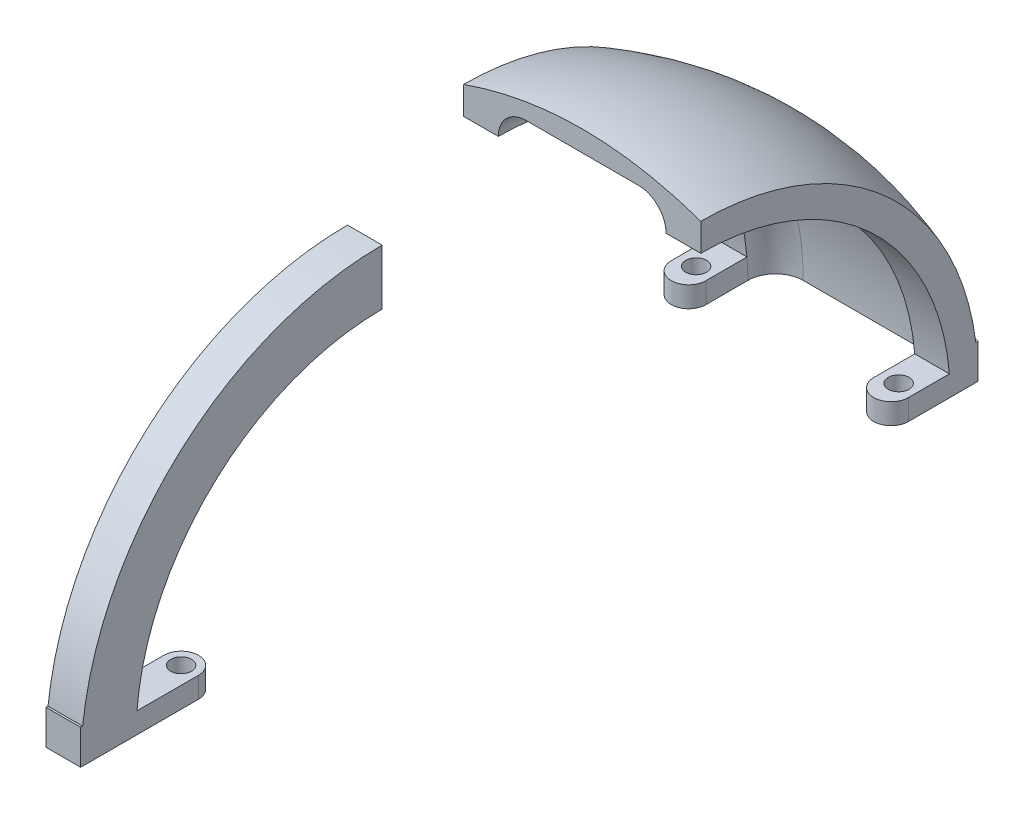
ISO-10303-21;
HEADER;
FILE_DESCRIPTION(('STEP AP214'),'2;1');
FILE_NAME('part.step','',(''),(''),'','','');
FILE_SCHEMA(('AUTOMOTIVE_DESIGN { 1 0 10303 214 1 1 1 1 }'));
ENDSEC;
DATA;
#1=APPLICATION_CONTEXT('core data for automotive mechanical design processes');
#2=APPLICATION_PROTOCOL_DEFINITION('international standard','automotive_design',2000,#1);
#3=PRODUCT_CONTEXT('',#1,'mechanical');
#4=PRODUCT('Part','Part','',(#3));
#5=PRODUCT_RELATED_PRODUCT_CATEGORY('part','',(#4));
#6=PRODUCT_DEFINITION_FORMATION('','',#4);
#7=PRODUCT_DEFINITION_CONTEXT('part definition',#1,'design');
#8=PRODUCT_DEFINITION('design','',#6,#7);
#9=PRODUCT_DEFINITION_SHAPE('','',#8);
#10=(LENGTH_UNIT() NAMED_UNIT(*) SI_UNIT(.MILLI.,.METRE.));
#11=(NAMED_UNIT(*) PLANE_ANGLE_UNIT() SI_UNIT($,.RADIAN.));
#12=(NAMED_UNIT(*) SI_UNIT($,.STERADIAN.) SOLID_ANGLE_UNIT());
#13=UNCERTAINTY_MEASURE_WITH_UNIT(LENGTH_MEASURE(1.E-05),#10,'distance_accuracy_value','');
#14=(GEOMETRIC_REPRESENTATION_CONTEXT(3) GLOBAL_UNCERTAINTY_ASSIGNED_CONTEXT((#13)) GLOBAL_UNIT_ASSIGNED_CONTEXT((#10,
#11,#12)) REPRESENTATION_CONTEXT('',''));
#15=CARTESIAN_POINT('',(0.,0.,0.));
#16=DIRECTION('',(0.,0.,1.));
#17=DIRECTION('',(1.,0.,0.));
#18=AXIS2_PLACEMENT_3D('',#15,#16,#17);
#19=CARTESIAN_POINT('',(1.94289029309402E-13,3.,41.9099999999999));
#20=DIRECTION('',(0.,-1.,0.));
#21=DIRECTION('',(0.,0.,-1.));
#22=AXIS2_PLACEMENT_3D('',#19,#20,#21);
#23=CYLINDRICAL_SURFACE('',#22,2.5);
#24=CARTESIAN_POINT('',(1.94289029309402E-13,0.,41.9099999999999));
#25=DIRECTION('',(0.,1.,0.));
#26=DIRECTION('',(0.,0.,1.));
#27=AXIS2_PLACEMENT_3D('',#24,#25,#26);
#28=CIRCLE('',#27,2.5);
#29=CARTESIAN_POINT('',(2.5000000000002,0.,41.9099999999999));
#30=VERTEX_POINT('',#29);
#31=CARTESIAN_POINT('',(-2.49999999999981,0.,41.9099999999999));
#32=VERTEX_POINT('',#31);
#33=EDGE_CURVE('E90',#30,#32,#28,.T.);
#34=ORIENTED_EDGE('',*,*,#33,.T.);
#35=DIRECTION('',(0.,-1.,0.));
#36=VECTOR('',#35,1.);
#37=CARTESIAN_POINT('',(-2.49999999999981,3.,41.9099999999999));
#38=LINE('',#37,#36);
#39=CARTESIAN_POINT('',(-2.49999999999981,3.,41.9099999999999));
#40=VERTEX_POINT('',#39);
#41=EDGE_CURVE('E56',#40,#32,#38,.T.);
#42=ORIENTED_EDGE('',*,*,#41,.F.);
#43=CARTESIAN_POINT('',(1.94289029309402E-13,3.,41.9099999999999));
#44=DIRECTION('',(0.,1.,0.));
#45=DIRECTION('',(0.,0.,1.));
#46=AXIS2_PLACEMENT_3D('',#43,#44,#45);
#47=CIRCLE('',#46,2.5);
#48=CARTESIAN_POINT('',(2.5000000000002,3.,41.9099999999999));
#49=VERTEX_POINT('',#48);
#50=EDGE_CURVE('E92',#49,#40,#47,.T.);
#51=ORIENTED_EDGE('',*,*,#50,.F.);
#52=DIRECTION('',(0.,-1.,0.));
#53=VECTOR('',#52,1.);
#54=CARTESIAN_POINT('',(2.5000000000002,3.,41.9099999999999));
#55=LINE('',#54,#53);
#56=EDGE_CURVE('E70',#49,#30,#55,.T.);
#57=ORIENTED_EDGE('',*,*,#56,.T.);
#58=EDGE_LOOP('',(#34,#42,#51,#57));
#59=FACE_BOUND('',#58,.T.);
#60=ADVANCED_FACE('F49',(#59),#23,.T.);
#61=CARTESIAN_POINT('',(-2.49999999999981,3.,0.));
#62=DIRECTION('',(1.,0.,0.));
#63=DIRECTION('',(0.,0.,-1.));
#64=AXIS2_PLACEMENT_3D('',#61,#62,#63);
#65=PLANE('',#64);
#66=DIRECTION('',(0.,0.,1.));
#67=VECTOR('',#66,1.);
#68=CARTESIAN_POINT('',(-2.49999999999981,5.,0.));
#69=LINE('',#68,#67);
#70=CARTESIAN_POINT('',(-2.4999999999998,5.,58.6216882336249));
#71=VERTEX_POINT('',#70);
#72=CARTESIAN_POINT('',(-2.4999999999998,5.,58.9099999999999));
#73=VERTEX_POINT('',#72);
#74=EDGE_CURVE('E275',#71,#73,#69,.T.);
#75=ORIENTED_EDGE('',*,*,#74,.F.);
#76=CARTESIAN_POINT('',(-2.4999999999998,0.,15.4099999999999));
#77=DIRECTION('',(1.,0.,0.));
#78=DIRECTION('',(0.,0.,-1.));
#79=AXIS2_PLACEMENT_3D('',#76,#77,#78);
#80=CIRCLE('',#79,43.5);
#81=CARTESIAN_POINT('',(-2.4999999999998,43.5,15.4099999999998));
#82=VERTEX_POINT('',#81);
#83=EDGE_CURVE('E281',#82,#71,#80,.T.);
#84=ORIENTED_EDGE('',*,*,#83,.F.);
#85=DIRECTION('',(0.,1.,0.));
#86=VECTOR('',#85,1.);
#87=CARTESIAN_POINT('',(-2.49999999999981,-15.4099999999999,15.41));
#88=LINE('',#87,#86);
#89=CARTESIAN_POINT('',(-2.49999999999981,35.5,15.4099999999998));
#90=VERTEX_POINT('',#89);
#91=EDGE_CURVE('E301',#90,#82,#88,.T.);
#92=ORIENTED_EDGE('',*,*,#91,.F.);
#93=CARTESIAN_POINT('',(-2.49999999999981,0.,15.4099999999999));
#94=DIRECTION('',(1.,0.,0.));
#95=DIRECTION('',(0.,0.,-1.));
#96=AXIS2_PLACEMENT_3D('',#93,#94,#95);
#97=CIRCLE('',#96,35.5);
#98=CARTESIAN_POINT('',(-2.49999999999981,3.,50.7830123116479));
#99=VERTEX_POINT('',#98);
#100=EDGE_CURVE('E131',#90,#99,#97,.T.);
#101=ORIENTED_EDGE('',*,*,#100,.T.);
#102=DIRECTION('',(0.,0.,1.));
#103=VECTOR('',#102,1.);
#104=CARTESIAN_POINT('',(-2.49999999999981,3.,0.));
#105=LINE('',#104,#103);
#106=EDGE_CURVE('E127',#40,#99,#105,.T.);
#107=ORIENTED_EDGE('',*,*,#106,.F.);
#108=ORIENTED_EDGE('',*,*,#41,.T.);
#109=DIRECTION('',(0.,0.,1.));
#110=VECTOR('',#109,1.);
#111=CARTESIAN_POINT('',(-2.49999999999981,0.,0.));
#112=LINE('',#111,#110);
#113=CARTESIAN_POINT('',(-2.4999999999998,0.,58.9099999999999));
#114=VERTEX_POINT('',#113);
#115=EDGE_CURVE('E103',#32,#114,#112,.T.);
#116=ORIENTED_EDGE('',*,*,#115,.T.);
#117=DIRECTION('',(0.,-1.,0.));
#118=VECTOR('',#117,1.);
#119=CARTESIAN_POINT('',(-2.4999999999998,3.,58.9099999999999));
#120=LINE('',#119,#118);
#121=EDGE_CURVE('E119',#73,#114,#120,.T.);
#122=ORIENTED_EDGE('',*,*,#121,.F.);
#123=EDGE_LOOP('',(#75,#84,#92,#101,#107,#108,#116,#122));
#124=FACE_BOUND('',#123,.T.);
#125=ADVANCED_FACE('F123',(#124),#65,.F.);
#126=CARTESIAN_POINT('',(0.,3.,58.9099999999999));
#127=DIRECTION('',(0.,0.,1.));
#128=DIRECTION('',(1.,0.,0.));
#129=AXIS2_PLACEMENT_3D('',#126,#127,#128);
#130=PLANE('',#129);
#131=DIRECTION('',(-1.,0.,0.));
#132=VECTOR('',#131,1.);
#133=CARTESIAN_POINT('',(0.,0.,58.9099999999999));
#134=LINE('',#133,#132);
#135=CARTESIAN_POINT('',(2.5000000000002,0.,58.9099999999999));
#136=VERTEX_POINT('',#135);
#137=EDGE_CURVE('E111',#136,#114,#134,.T.);
#138=ORIENTED_EDGE('',*,*,#137,.F.);
#139=DIRECTION('',(0.,-1.,0.));
#140=VECTOR('',#139,1.);
#141=CARTESIAN_POINT('',(2.5000000000002,3.,58.9099999999999));
#142=LINE('',#141,#140);
#143=CARTESIAN_POINT('',(2.5000000000002,5.,58.9099999999999));
#144=VERTEX_POINT('',#143);
#145=EDGE_CURVE('E94',#144,#136,#142,.T.);
#146=ORIENTED_EDGE('',*,*,#145,.F.);
#147=DIRECTION('',(-1.,0.,0.));
#148=VECTOR('',#147,1.);
#149=CARTESIAN_POINT('',(0.,5.,58.9099999999999));
#150=LINE('',#149,#148);
#151=EDGE_CURVE('E284',#144,#73,#150,.T.);
#152=ORIENTED_EDGE('',*,*,#151,.T.);
#153=ORIENTED_EDGE('',*,*,#121,.T.);
#154=EDGE_LOOP('',(#138,#146,#152,#153));
#155=FACE_BOUND('',#154,.T.);
#156=ADVANCED_FACE('F162',(#155),#130,.T.);
#157=CARTESIAN_POINT('',(2.50000000000019,3.,0.));
#158=DIRECTION('',(1.,0.,0.));
#159=DIRECTION('',(0.,0.,-1.));
#160=AXIS2_PLACEMENT_3D('',#157,#158,#159);
#161=PLANE('',#160);
#162=ORIENTED_EDGE('',*,*,#145,.T.);
#163=DIRECTION('',(0.,0.,1.));
#164=VECTOR('',#163,1.);
#165=CARTESIAN_POINT('',(2.50000000000019,0.,0.));
#166=LINE('',#165,#164);
#167=EDGE_CURVE('E101',#30,#136,#166,.T.);
#168=ORIENTED_EDGE('',*,*,#167,.F.);
#169=ORIENTED_EDGE('',*,*,#56,.F.);
#170=DIRECTION('',(0.,0.,1.));
#171=VECTOR('',#170,1.);
#172=CARTESIAN_POINT('',(2.50000000000019,3.,0.));
#173=LINE('',#172,#171);
#174=CARTESIAN_POINT('',(2.5000000000002,3.,50.7830123116479));
#175=VERTEX_POINT('',#174);
#176=EDGE_CURVE('E134',#49,#175,#173,.T.);
#177=ORIENTED_EDGE('',*,*,#176,.T.);
#178=CARTESIAN_POINT('',(2.5000000000002,0.,15.4099999999999));
#179=DIRECTION('',(1.,0.,0.));
#180=DIRECTION('',(0.,0.,-1.));
#181=AXIS2_PLACEMENT_3D('',#178,#179,#180);
#182=CIRCLE('',#181,35.5);
#183=CARTESIAN_POINT('',(2.5000000000002,35.5,15.4099999999998));
#184=VERTEX_POINT('',#183);
#185=EDGE_CURVE('E293',#184,#175,#182,.T.);
#186=ORIENTED_EDGE('',*,*,#185,.F.);
#187=DIRECTION('',(0.,1.,0.));
#188=VECTOR('',#187,1.);
#189=CARTESIAN_POINT('',(2.50000000000019,-15.4099999999999,15.41));
#190=LINE('',#189,#188);
#191=CARTESIAN_POINT('',(2.5000000000002,43.5,15.4099999999998));
#192=VERTEX_POINT('',#191);
#193=EDGE_CURVE('E296',#184,#192,#190,.T.);
#194=ORIENTED_EDGE('',*,*,#193,.T.);
#195=CARTESIAN_POINT('',(2.5000000000002,0.,15.4099999999999));
#196=DIRECTION('',(1.,0.,0.));
#197=DIRECTION('',(0.,0.,-1.));
#198=AXIS2_PLACEMENT_3D('',#195,#196,#197);
#199=CIRCLE('',#198,43.5);
#200=CARTESIAN_POINT('',(2.5000000000002,5.,58.6216882336249));
#201=VERTEX_POINT('',#200);
#202=EDGE_CURVE('E63',#192,#201,#199,.T.);
#203=ORIENTED_EDGE('',*,*,#202,.T.);
#204=DIRECTION('',(0.,0.,1.));
#205=VECTOR('',#204,1.);
#206=CARTESIAN_POINT('',(2.50000000000019,5.,0.));
#207=LINE('',#206,#205);
#208=EDGE_CURVE('E105',#201,#144,#207,.T.);
#209=ORIENTED_EDGE('',*,*,#208,.T.);
#210=EDGE_LOOP('',(#162,#168,#169,#177,#186,#194,#203,#209));
#211=FACE_BOUND('',#210,.T.);
#212=ADVANCED_FACE('F107',(#211),#161,.T.);
#213=CARTESIAN_POINT('',(1.94289029309402E-13,3.,41.9099999999999));
#214=DIRECTION('',(0.,-1.,0.));
#215=DIRECTION('',(0.,0.,-1.));
#216=AXIS2_PLACEMENT_3D('',#213,#214,#215);
#217=CYLINDRICAL_SURFACE('',#216,1.5);
#218=CARTESIAN_POINT('',(1.94289029309402E-13,3.,41.9099999999999));
#219=DIRECTION('',(0.,1.,0.));
#220=DIRECTION('',(0.,0.,1.));
#221=AXIS2_PLACEMENT_3D('',#218,#219,#220);
#222=CIRCLE('',#221,1.5);
#223=CARTESIAN_POINT('',(1.94289029309402E-13,3.,43.4099999999999));
#224=VERTEX_POINT('',#223);
#225=EDGE_CURVE('E95',#224,#224,#222,.T.);
#226=ORIENTED_EDGE('',*,*,#225,.T.);
#227=EDGE_LOOP('',(#226));
#228=FACE_BOUND('',#227,.T.);
#229=CARTESIAN_POINT('',(1.94289029309402E-13,0.,41.9099999999999));
#230=DIRECTION('',(0.,1.,0.));
#231=DIRECTION('',(0.,0.,1.));
#232=AXIS2_PLACEMENT_3D('',#229,#230,#231);
#233=CIRCLE('',#232,1.5);
#234=CARTESIAN_POINT('',(1.94289029309402E-13,0.,43.4099999999999));
#235=VERTEX_POINT('',#234);
#236=EDGE_CURVE('E110',#235,#235,#233,.T.);
#237=ORIENTED_EDGE('',*,*,#236,.F.);
#238=EDGE_LOOP('',(#237));
#239=FACE_BOUND('',#238,.T.);
#240=ADVANCED_FACE('F146',(#228,#239),#217,.F.);
#241=CARTESIAN_POINT('',(0.,3.,0.));
#242=DIRECTION('',(0.,1.,0.));
#243=DIRECTION('',(0.,0.,1.));
#244=AXIS2_PLACEMENT_3D('',#241,#242,#243);
#245=PLANE('',#244);
#246=DIRECTION('',(1.,0.,0.));
#247=VECTOR('',#246,1.);
#248=CARTESIAN_POINT('',(-2.49999999999981,3.,50.7830123116479));
#249=LINE('',#248,#247);
#250=EDGE_CURVE('E285',#175,#99,#249,.F.);
#251=ORIENTED_EDGE('',*,*,#250,.F.);
#252=ORIENTED_EDGE('',*,*,#176,.F.);
#253=ORIENTED_EDGE('',*,*,#50,.T.);
#254=ORIENTED_EDGE('',*,*,#106,.T.);
#255=EDGE_LOOP('',(#251,#252,#253,#254));
#256=FACE_BOUND('',#255,.T.);
#257=ORIENTED_EDGE('',*,*,#225,.F.);
#258=EDGE_LOOP('',(#257));
#259=FACE_BOUND('',#258,.T.);
#260=ADVANCED_FACE('F136',(#256,#259),#245,.T.);
#261=CARTESIAN_POINT('',(0.,0.,0.));
#262=DIRECTION('',(0.,1.,0.));
#263=DIRECTION('',(0.,0.,1.));
#264=AXIS2_PLACEMENT_3D('',#261,#262,#263);
#265=PLANE('',#264);
#266=ORIENTED_EDGE('',*,*,#167,.T.);
#267=ORIENTED_EDGE('',*,*,#137,.T.);
#268=ORIENTED_EDGE('',*,*,#115,.F.);
#269=ORIENTED_EDGE('',*,*,#33,.F.);
#270=EDGE_LOOP('',(#266,#267,#268,#269));
#271=FACE_BOUND('',#270,.T.);
#272=ORIENTED_EDGE('',*,*,#236,.T.);
#273=EDGE_LOOP('',(#272));
#274=FACE_BOUND('',#273,.T.);
#275=ADVANCED_FACE('F98',(#271,#274),#265,.F.);
#276=CARTESIAN_POINT('',(0.,5.,0.));
#277=DIRECTION('',(0.,1.,0.));
#278=DIRECTION('',(0.,0.,1.));
#279=AXIS2_PLACEMENT_3D('',#276,#277,#278);
#280=PLANE('',#279);
#281=DIRECTION('',(1.,0.,0.));
#282=VECTOR('',#281,1.);
#283=CARTESIAN_POINT('',(-2.49999999999981,5.,58.6216882336249));
#284=LINE('',#283,#282);
#285=EDGE_CURVE('E12',#71,#201,#284,.T.);
#286=ORIENTED_EDGE('',*,*,#285,.F.);
#287=ORIENTED_EDGE('',*,*,#74,.T.);
#288=ORIENTED_EDGE('',*,*,#151,.F.);
#289=ORIENTED_EDGE('',*,*,#208,.F.);
#290=EDGE_LOOP('',(#286,#287,#288,#289));
#291=FACE_BOUND('',#290,.T.);
#292=ADVANCED_FACE('F154',(#291),#280,.T.);
#293=CARTESIAN_POINT('',(-2.49999999999981,0.,15.4099999999999));
#294=DIRECTION('',(1.,0.,0.));
#295=DIRECTION('',(0.,0.,-1.));
#296=AXIS2_PLACEMENT_3D('',#293,#294,#295);
#297=CYLINDRICAL_SURFACE('',#296,35.5);
#298=ORIENTED_EDGE('',*,*,#185,.T.);
#299=ORIENTED_EDGE('',*,*,#250,.T.);
#300=ORIENTED_EDGE('',*,*,#100,.F.);
#301=DIRECTION('',(1.,0.,0.));
#302=VECTOR('',#301,1.);
#303=CARTESIAN_POINT('',(0.,35.5,15.4099999999998));
#304=LINE('',#303,#302);
#305=EDGE_CURVE('E303',#90,#184,#304,.T.);
#306=ORIENTED_EDGE('',*,*,#305,.T.);
#307=EDGE_LOOP('',(#298,#299,#300,#306));
#308=FACE_BOUND('',#307,.T.);
#309=ADVANCED_FACE('F210',(#308),#297,.F.);
#310=CARTESIAN_POINT('',(-2.49999999999981,0.,15.4099999999999));
#311=DIRECTION('',(1.,0.,0.));
#312=DIRECTION('',(0.,0.,-1.));
#313=AXIS2_PLACEMENT_3D('',#310,#311,#312);
#314=CYLINDRICAL_SURFACE('',#313,43.5);
#315=ORIENTED_EDGE('',*,*,#83,.T.);
#316=ORIENTED_EDGE('',*,*,#285,.T.);
#317=ORIENTED_EDGE('',*,*,#202,.F.);
#318=DIRECTION('',(-1.,0.,0.));
#319=VECTOR('',#318,1.);
#320=CARTESIAN_POINT('',(0.,43.5,15.4099999999998));
#321=LINE('',#320,#319);
#322=EDGE_CURVE('E298',#192,#82,#321,.T.);
#323=ORIENTED_EDGE('',*,*,#322,.T.);
#324=EDGE_LOOP('',(#315,#316,#317,#323));
#325=FACE_BOUND('',#324,.T.);
#326=ADVANCED_FACE('F216',(#325),#314,.T.);
#327=CARTESIAN_POINT('',(0.,-15.4099999999999,15.41));
#328=DIRECTION('',(0.,0.,-1.));
#329=DIRECTION('',(0.,1.,0.));
#330=AXIS2_PLACEMENT_3D('',#327,#328,#329);
#331=PLANE('',#330);
#332=ORIENTED_EDGE('',*,*,#305,.F.);
#333=ORIENTED_EDGE('',*,*,#91,.T.);
#334=ORIENTED_EDGE('',*,*,#322,.F.);
#335=ORIENTED_EDGE('',*,*,#193,.F.);
#336=EDGE_LOOP('',(#332,#333,#334,#335));
#337=FACE_BOUND('',#336,.T.);
#338=ADVANCED_FACE('F225',(#337),#331,.T.);
#339=CLOSED_SHELL('',(#60,#125,#156,#212,#240,#260,#275,#292,#309,#326,#338));
#340=MANIFOLD_SOLID_BREP('B2',#339);
#341=CARTESIAN_POINT('',(-10.2000000000002,3.,0.));
#342=DIRECTION('',(-1.,0.,0.));
#343=DIRECTION('',(0.,0.,1.));
#344=AXIS2_PLACEMENT_3D('',#341,#342,#343);
#345=PLANE('',#344);
#346=CARTESIAN_POINT('',(-10.2000000000002,0.,-14.0459064129745));
#347=DIRECTION('',(-1.,0.,0.));
#348=DIRECTION('',(0.,0.,1.));
#349=AXIS2_PLACEMENT_3D('',#346,#347,#348);
#350=CIRCLE('',#349,36.);
#351=CARTESIAN_POINT('',(-10.2000000000002,3.,-49.9206886422786));
#352=VERTEX_POINT('',#351);
#353=CARTESIAN_POINT('',(-10.2000000000002,0.,-50.0459064129744));
#354=VERTEX_POINT('',#353);
#355=EDGE_CURVE('E640',#352,#354,#350,.T.);
#356=ORIENTED_EDGE('',*,*,#355,.F.);
#357=DIRECTION('',(0.,0.,-1.));
#358=VECTOR('',#357,1.);
#359=CARTESIAN_POINT('',(-10.2000000000002,3.,0.));
#360=LINE('',#359,#358);
#361=CARTESIAN_POINT('',(-10.2000000000002,3.,-44.));
#362=VERTEX_POINT('',#361);
#363=EDGE_CURVE('E669',#362,#352,#360,.T.);
#364=ORIENTED_EDGE('',*,*,#363,.F.);
#365=DIRECTION('',(0.,-1.,0.));
#366=VECTOR('',#365,1.);
#367=CARTESIAN_POINT('',(-10.2000000000002,3.,-44.));
#368=LINE('',#367,#366);
#369=CARTESIAN_POINT('',(-10.2000000000002,0.,-44.));
#370=VERTEX_POINT('',#369);
#371=EDGE_CURVE('E600',#362,#370,#368,.T.);
#372=ORIENTED_EDGE('',*,*,#371,.T.);
#373=DIRECTION('',(0.,0.,-1.));
#374=VECTOR('',#373,1.);
#375=CARTESIAN_POINT('',(-10.2000000000002,0.,0.));
#376=LINE('',#375,#374);
#377=EDGE_CURVE('E564',#370,#354,#376,.T.);
#378=ORIENTED_EDGE('',*,*,#377,.T.);
#379=EDGE_LOOP('',(#356,#364,#372,#378));
#380=FACE_BOUND('',#379,.T.);
#381=ADVANCED_FACE('F333',(#380),#345,.F.);
#382=CARTESIAN_POINT('',(14.0099999999998,3.,0.));
#383=DIRECTION('',(-1.,0.,0.));
#384=DIRECTION('',(0.,0.,1.));
#385=AXIS2_PLACEMENT_3D('',#382,#383,#384);
#386=PLANE('',#385);
#387=CARTESIAN_POINT('',(14.0099999999998,0.,-14.0459064129745));
#388=DIRECTION('',(-1.,0.,0.));
#389=DIRECTION('',(0.,0.,1.));
#390=AXIS2_PLACEMENT_3D('',#387,#388,#389);
#391=CIRCLE('',#390,36.);
#392=CARTESIAN_POINT('',(14.0099999999998,3.,-49.9206886422787));
#393=VERTEX_POINT('',#392);
#394=CARTESIAN_POINT('',(14.0099999999998,0.,-50.0459064129744));
#395=VERTEX_POINT('',#394);
#396=EDGE_CURVE('E653',#393,#395,#391,.T.);
#397=ORIENTED_EDGE('',*,*,#396,.T.);
#398=DIRECTION('',(0.,0.,-1.));
#399=VECTOR('',#398,1.);
#400=CARTESIAN_POINT('',(14.0099999999998,0.,0.));
#401=LINE('',#400,#399);
#402=CARTESIAN_POINT('',(14.0099999999998,0.,-44.));
#403=VERTEX_POINT('',#402);
#404=EDGE_CURVE('E574',#403,#395,#401,.T.);
#405=ORIENTED_EDGE('',*,*,#404,.F.);
#406=DIRECTION('',(0.,-1.,0.));
#407=VECTOR('',#406,1.);
#408=CARTESIAN_POINT('',(14.0099999999998,3.,-44.));
#409=LINE('',#408,#407);
#410=CARTESIAN_POINT('',(14.0099999999998,3.,-44.));
#411=VERTEX_POINT('',#410);
#412=EDGE_CURVE('E597',#411,#403,#409,.T.);
#413=ORIENTED_EDGE('',*,*,#412,.F.);
#414=DIRECTION('',(0.,0.,-1.));
#415=VECTOR('',#414,1.);
#416=CARTESIAN_POINT('',(14.0099999999998,3.,0.));
#417=LINE('',#416,#415);
#418=EDGE_CURVE('E672',#411,#393,#417,.T.);
#419=ORIENTED_EDGE('',*,*,#418,.T.);
#420=EDGE_LOOP('',(#397,#405,#413,#419));
#421=FACE_BOUND('',#420,.T.);
#422=ADVANCED_FACE('F527',(#421),#386,.T.);
#423=CARTESIAN_POINT('',(0.,3.,0.));
#424=DIRECTION('',(0.,1.,0.));
#425=DIRECTION('',(0.,0.,1.));
#426=AXIS2_PLACEMENT_3D('',#423,#424,#425);
#427=PLANE('',#426);
#428=CARTESIAN_POINT('',(-12.7049136334305,3.,-45.0912348738055));
#429=DIRECTION('',(0.,1.,0.));
#430=DIRECTION('',(0.,0.,1.));
#431=AXIS2_PLACEMENT_3D('',#428,#429,#430);
#432=CIRCLE('',#431,1.5);
#433=CARTESIAN_POINT('',(-12.7049136334305,3.,-43.5912348738055));
#434=VERTEX_POINT('',#433);
#435=EDGE_CURVE('E548',#434,#434,#432,.T.);
#436=ORIENTED_EDGE('',*,*,#435,.F.);
#437=EDGE_LOOP('',(#436));
#438=FACE_BOUND('',#437,.T.);
#439=ORIENTED_EDGE('',*,*,#363,.T.);
#440=DIRECTION('',(-1.,0.,0.));
#441=VECTOR('',#440,1.);
#442=CARTESIAN_POINT('',(-6.20000000000024,3.,-49.9206886422786));
#443=LINE('',#442,#441);
#444=CARTESIAN_POINT('',(-15.2000000000002,3.,-49.9206886422786));
#445=VERTEX_POINT('',#444);
#446=EDGE_CURVE('E453',#352,#445,#443,.T.);
#447=ORIENTED_EDGE('',*,*,#446,.T.);
#448=DIRECTION('',(0.,0.,-1.));
#449=VECTOR('',#448,1.);
#450=CARTESIAN_POINT('',(-15.2000000000002,3.,0.));
#451=LINE('',#450,#449);
#452=CARTESIAN_POINT('',(-15.2000000000002,3.,-44.));
#453=VERTEX_POINT('',#452);
#454=EDGE_CURVE('E631',#453,#445,#451,.T.);
#455=ORIENTED_EDGE('',*,*,#454,.F.);
#456=CARTESIAN_POINT('',(-12.7000000000002,3.,-44.));
#457=DIRECTION('',(0.,1.,0.));
#458=DIRECTION('',(0.,0.,1.));
#459=AXIS2_PLACEMENT_3D('',#456,#457,#458);
#460=CIRCLE('',#459,2.5);
#461=EDGE_CURVE('E628',#453,#362,#460,.T.);
#462=ORIENTED_EDGE('',*,*,#461,.T.);
#463=EDGE_LOOP('',(#439,#447,#455,#462));
#464=FACE_BOUND('',#463,.T.);
#465=ADVANCED_FACE('F523',(#438,#464),#427,.T.);
#466=DIRECTION('',(-1.,0.,0.));
#467=VECTOR('',#466,1.);
#468=CARTESIAN_POINT('',(-6.20000000000024,3.,-49.9206886422786));
#469=LINE('',#468,#467);
#470=CARTESIAN_POINT('',(19.0099999999998,3.,-49.9206886422786));
#471=VERTEX_POINT('',#470);
#472=EDGE_CURVE('E354',#393,#471,#469,.F.);
#473=ORIENTED_EDGE('',*,*,#472,.F.);
#474=ORIENTED_EDGE('',*,*,#418,.F.);
#475=CARTESIAN_POINT('',(16.5099999999998,3.,-44.));
#476=DIRECTION('',(0.,1.,0.));
#477=DIRECTION('',(0.,0.,1.));
#478=AXIS2_PLACEMENT_3D('',#475,#476,#477);
#479=CIRCLE('',#478,2.5);
#480=CARTESIAN_POINT('',(19.0099999999998,3.,-44.));
#481=VERTEX_POINT('',#480);
#482=EDGE_CURVE('E673',#411,#481,#479,.T.);
#483=ORIENTED_EDGE('',*,*,#482,.T.);
#484=DIRECTION('',(0.,0.,-1.));
#485=VECTOR('',#484,1.);
#486=CARTESIAN_POINT('',(19.0099999999998,3.,0.));
#487=LINE('',#486,#485);
#488=EDGE_CURVE('E359',#481,#471,#487,.T.);
#489=ORIENTED_EDGE('',*,*,#488,.T.);
#490=EDGE_LOOP('',(#473,#474,#483,#489));
#491=FACE_BOUND('',#490,.T.);
#492=CARTESIAN_POINT('',(16.5326791988903,3.,-45.0783751917841));
#493=DIRECTION('',(0.,1.,0.));
#494=DIRECTION('',(0.,0.,1.));
#495=AXIS2_PLACEMENT_3D('',#492,#493,#494);
#496=CIRCLE('',#495,1.5);
#497=CARTESIAN_POINT('',(16.5326791988903,3.,-43.5783751917841));
#498=VERTEX_POINT('',#497);
#499=EDGE_CURVE('E593',#498,#498,#496,.T.);
#500=ORIENTED_EDGE('',*,*,#499,.F.);
#501=EDGE_LOOP('',(#500));
#502=FACE_BOUND('',#501,.T.);
#503=ADVANCED_FACE('F526',(#491,#502),#427,.T.);
#504=CARTESIAN_POINT('',(-15.2000000000002,3.,0.));
#505=DIRECTION('',(-1.,0.,0.));
#506=DIRECTION('',(0.,0.,1.));
#507=AXIS2_PLACEMENT_3D('',#504,#505,#506);
#508=PLANE('',#507);
#509=DIRECTION('',(0.,-1.,0.));
#510=VECTOR('',#509,1.);
#511=CARTESIAN_POINT('',(-15.2000000000002,3.,-54.0459064129745));
#512=LINE('',#511,#510);
#513=CARTESIAN_POINT('',(-15.2000000000002,5.,-54.0459064129745));
#514=VERTEX_POINT('',#513);
#515=CARTESIAN_POINT('',(-15.2000000000002,0.,-54.0459064129745));
#516=VERTEX_POINT('',#515);
#517=EDGE_CURVE('E554',#514,#516,#512,.T.);
#518=ORIENTED_EDGE('',*,*,#517,.T.);
#519=DIRECTION('',(0.,0.,-1.));
#520=VECTOR('',#519,1.);
#521=CARTESIAN_POINT('',(-15.2000000000002,0.,0.));
#522=LINE('',#521,#520);
#523=CARTESIAN_POINT('',(-15.2000000000002,0.,-44.));
#524=VERTEX_POINT('',#523);
#525=EDGE_CURVE('E558',#524,#516,#522,.T.);
#526=ORIENTED_EDGE('',*,*,#525,.F.);
#527=DIRECTION('',(0.,-1.,0.));
#528=VECTOR('',#527,1.);
#529=CARTESIAN_POINT('',(-15.2000000000002,3.,-44.));
#530=LINE('',#529,#528);
#531=EDGE_CURVE('E347',#453,#524,#530,.T.);
#532=ORIENTED_EDGE('',*,*,#531,.F.);
#533=ORIENTED_EDGE('',*,*,#454,.T.);
#534=CARTESIAN_POINT('',(-15.2000000000002,0.,-14.0459064129745));
#535=DIRECTION('',(-1.,0.,0.));
#536=DIRECTION('',(0.,0.,1.));
#537=AXIS2_PLACEMENT_3D('',#534,#535,#536);
#538=CIRCLE('',#537,36.);
#539=CARTESIAN_POINT('',(-15.2000000000002,36.,-14.0459064129744));
#540=VERTEX_POINT('',#539);
#541=EDGE_CURVE('E633',#540,#445,#538,.T.);
#542=ORIENTED_EDGE('',*,*,#541,.F.);
#543=DIRECTION('',(0.,1.,0.));
#544=VECTOR('',#543,1.);
#545=CARTESIAN_POINT('',(-15.2000000000002,-14.0459064129745,-14.0459064129745));
#546=LINE('',#545,#544);
#547=CARTESIAN_POINT('',(-15.2000000000002,40.,-14.0459064129743));
#548=VERTEX_POINT('',#547);
#549=EDGE_CURVE('E482',#540,#548,#546,.T.);
#550=ORIENTED_EDGE('',*,*,#549,.T.);
#551=CARTESIAN_POINT('',(-15.2000000000002,0.,-14.0459064129745));
#552=DIRECTION('',(-1.,0.,0.));
#553=DIRECTION('',(0.,0.,1.));
#554=AXIS2_PLACEMENT_3D('',#551,#552,#553);
#555=CIRCLE('',#554,40.);
#556=CARTESIAN_POINT('',(-15.2000000000002,5.,-53.7321760789433));
#557=VERTEX_POINT('',#556);
#558=EDGE_CURVE('E641',#548,#557,#555,.T.);
#559=ORIENTED_EDGE('',*,*,#558,.T.);
#560=DIRECTION('',(0.,0.,-1.));
#561=VECTOR('',#560,1.);
#562=CARTESIAN_POINT('',(-15.2000000000002,5.,0.));
#563=LINE('',#562,#561);
#564=EDGE_CURVE('E616',#557,#514,#563,.T.);
#565=ORIENTED_EDGE('',*,*,#564,.T.);
#566=EDGE_LOOP('',(#518,#526,#532,#533,#542,#550,#559,#565));
#567=FACE_BOUND('',#566,.T.);
#568=ADVANCED_FACE('F614',(#567),#508,.T.);
#569=CARTESIAN_POINT('',(-12.7000000000002,3.,-44.));
#570=DIRECTION('',(0.,-1.,0.));
#571=DIRECTION('',(0.,0.,-1.));
#572=AXIS2_PLACEMENT_3D('',#569,#570,#571);
#573=CYLINDRICAL_SURFACE('',#572,2.5);
#574=CARTESIAN_POINT('',(-12.7000000000002,0.,-44.));
#575=DIRECTION('',(0.,1.,0.));
#576=DIRECTION('',(0.,0.,1.));
#577=AXIS2_PLACEMENT_3D('',#574,#575,#576);
#578=CIRCLE('',#577,2.5);
#579=EDGE_CURVE('E561',#524,#370,#578,.T.);
#580=ORIENTED_EDGE('',*,*,#579,.T.);
#581=ORIENTED_EDGE('',*,*,#371,.F.);
#582=ORIENTED_EDGE('',*,*,#461,.F.);
#583=ORIENTED_EDGE('',*,*,#531,.T.);
#584=EDGE_LOOP('',(#580,#581,#582,#583));
#585=FACE_BOUND('',#584,.T.);
#586=ADVANCED_FACE('F625',(#585),#573,.T.);
#587=CARTESIAN_POINT('',(16.5099999999998,3.,-44.));
#588=DIRECTION('',(0.,-1.,0.));
#589=DIRECTION('',(0.,0.,-1.));
#590=AXIS2_PLACEMENT_3D('',#587,#588,#589);
#591=CYLINDRICAL_SURFACE('',#590,2.5);
#592=CARTESIAN_POINT('',(16.5099999999998,0.,-44.));
#593=DIRECTION('',(0.,1.,0.));
#594=DIRECTION('',(0.,0.,1.));
#595=AXIS2_PLACEMENT_3D('',#592,#593,#594);
#596=CIRCLE('',#595,2.5);
#597=CARTESIAN_POINT('',(19.0099999999998,0.,-44.));
#598=VERTEX_POINT('',#597);
#599=EDGE_CURVE('E577',#403,#598,#596,.T.);
#600=ORIENTED_EDGE('',*,*,#599,.T.);
#601=DIRECTION('',(0.,-1.,0.));
#602=VECTOR('',#601,1.);
#603=CARTESIAN_POINT('',(19.0099999999998,3.,-44.));
#604=LINE('',#603,#602);
#605=EDGE_CURVE('E594',#481,#598,#604,.T.);
#606=ORIENTED_EDGE('',*,*,#605,.F.);
#607=ORIENTED_EDGE('',*,*,#482,.F.);
#608=ORIENTED_EDGE('',*,*,#412,.T.);
#609=EDGE_LOOP('',(#600,#606,#607,#608));
#610=FACE_BOUND('',#609,.T.);
#611=ADVANCED_FACE('F678',(#610),#591,.T.);
#612=CARTESIAN_POINT('',(19.0099999999998,3.,0.));
#613=DIRECTION('',(-1.,0.,0.));
#614=DIRECTION('',(0.,0.,1.));
#615=AXIS2_PLACEMENT_3D('',#612,#613,#614);
#616=PLANE('',#615);
#617=DIRECTION('',(0.,0.,-1.));
#618=VECTOR('',#617,1.);
#619=CARTESIAN_POINT('',(19.0099999999998,5.,0.));
#620=LINE('',#619,#618);
#621=CARTESIAN_POINT('',(19.0099999999998,5.,-53.7321760789433));
#622=VERTEX_POINT('',#621);
#623=CARTESIAN_POINT('',(19.0099999999998,5.,-54.0459064129745));
#624=VERTEX_POINT('',#623);
#625=EDGE_CURVE('E559',#622,#624,#620,.T.);
#626=ORIENTED_EDGE('',*,*,#625,.F.);
#627=CARTESIAN_POINT('',(19.0099999999998,0.,-14.0459064129745));
#628=DIRECTION('',(-1.,0.,0.));
#629=DIRECTION('',(0.,0.,1.));
#630=AXIS2_PLACEMENT_3D('',#627,#628,#629);
#631=CIRCLE('',#630,40.);
#632=CARTESIAN_POINT('',(19.0099999999998,40.,-14.0459064129743));
#633=VERTEX_POINT('',#632);
#634=EDGE_CURVE('E461',#633,#622,#631,.T.);
#635=ORIENTED_EDGE('',*,*,#634,.F.);
#636=DIRECTION('',(0.,-1.,0.));
#637=VECTOR('',#636,1.);
#638=CARTESIAN_POINT('',(19.0099999999998,-14.0459064129745,-14.0459064129745));
#639=LINE('',#638,#637);
#640=CARTESIAN_POINT('',(19.0099999999998,36.,-14.0459064129744));
#641=VERTEX_POINT('',#640);
#642=EDGE_CURVE('E457',#633,#641,#639,.T.);
#643=ORIENTED_EDGE('',*,*,#642,.T.);
#644=CARTESIAN_POINT('',(19.0099999999998,0.,-14.0459064129745));
#645=DIRECTION('',(-1.,0.,0.));
#646=DIRECTION('',(0.,0.,1.));
#647=AXIS2_PLACEMENT_3D('',#644,#645,#646);
#648=CIRCLE('',#647,36.);
#649=EDGE_CURVE('E445',#641,#471,#648,.T.);
#650=ORIENTED_EDGE('',*,*,#649,.T.);
#651=ORIENTED_EDGE('',*,*,#488,.F.);
#652=ORIENTED_EDGE('',*,*,#605,.T.);
#653=DIRECTION('',(0.,0.,-1.));
#654=VECTOR('',#653,1.);
#655=CARTESIAN_POINT('',(19.0099999999998,0.,0.));
#656=LINE('',#655,#654);
#657=CARTESIAN_POINT('',(19.0099999999998,0.,-54.0459064129745));
#658=VERTEX_POINT('',#657);
#659=EDGE_CURVE('E580',#598,#658,#656,.T.);
#660=ORIENTED_EDGE('',*,*,#659,.T.);
#661=DIRECTION('',(0.,-1.,0.));
#662=VECTOR('',#661,1.);
#663=CARTESIAN_POINT('',(19.0099999999998,3.,-54.0459064129745));
#664=LINE('',#663,#662);
#665=EDGE_CURVE('E598',#624,#658,#664,.T.);
#666=ORIENTED_EDGE('',*,*,#665,.F.);
#667=EDGE_LOOP('',(#626,#635,#643,#650,#651,#652,#660,#666));
#668=FACE_BOUND('',#667,.T.);
#669=ADVANCED_FACE('F459',(#668),#616,.F.);
#670=CARTESIAN_POINT('',(-15.2000000000002,3.,-54.0459064129745));
#671=CARTESIAN_POINT('',(1.90499999999976,3.,-60.0459064129745));
#672=CARTESIAN_POINT('',(19.0099999999998,3.,-54.0459064129745));
#673=B_SPLINE_CURVE_WITH_KNOTS('',2,(#670,#671,#672),.UNSPECIFIED.,.F.,.F.,(3,3),(0.,1.),.UNSPECIFIED.);
#674=DIRECTION('',(0.,-1.,0.));
#675=VECTOR('',#674,1.);
#676=SURFACE_OF_LINEAR_EXTRUSION('',#673,#675);
#677=CARTESIAN_POINT('',(-15.2000000000002,0.,-54.0459064129745));
#678=CARTESIAN_POINT('',(1.90499999999976,0.,-60.0459064129745));
#679=CARTESIAN_POINT('',(19.0099999999998,0.,-54.0459064129745));
#680=B_SPLINE_CURVE_WITH_KNOTS('',2,(#677,#678,#679),.UNSPECIFIED.,.F.,.F.,(3,3),(0.,1.),.UNSPECIFIED.);
#681=EDGE_CURVE('E582',#516,#658,#680,.T.);
#682=ORIENTED_EDGE('',*,*,#681,.F.);
#683=ORIENTED_EDGE('',*,*,#517,.F.);
#684=CARTESIAN_POINT('',(-15.2000000000002,5.,-54.0459064129745));
#685=CARTESIAN_POINT('',(1.90499999999976,5.,-60.0459064129745));
#686=CARTESIAN_POINT('',(19.0099999999998,5.,-54.0459064129745));
#687=B_SPLINE_CURVE_WITH_KNOTS('',2,(#684,#685,#686),.UNSPECIFIED.,.F.,.F.,(3,3),(0.,1.),.UNSPECIFIED.);
#688=EDGE_CURVE('E657',#514,#624,#687,.T.);
#689=ORIENTED_EDGE('',*,*,#688,.T.);
#690=ORIENTED_EDGE('',*,*,#665,.T.);
#691=EDGE_LOOP('',(#682,#683,#689,#690));
#692=FACE_BOUND('',#691,.T.);
#693=ADVANCED_FACE('F536',(#692),#676,.T.);
#694=CARTESIAN_POINT('',(16.5326791988903,3.,-45.0783751917841));
#695=DIRECTION('',(0.,-1.,0.));
#696=DIRECTION('',(0.,0.,-1.));
#697=AXIS2_PLACEMENT_3D('',#694,#695,#696);
#698=CYLINDRICAL_SURFACE('',#697,1.5);
#699=ORIENTED_EDGE('',*,*,#499,.T.);
#700=EDGE_LOOP('',(#699));
#701=FACE_BOUND('',#700,.T.);
#702=CARTESIAN_POINT('',(16.5326791988903,0.,-45.0783751917841));
#703=DIRECTION('',(0.,1.,0.));
#704=DIRECTION('',(0.,0.,1.));
#705=AXIS2_PLACEMENT_3D('',#702,#703,#704);
#706=CIRCLE('',#705,1.5);
#707=CARTESIAN_POINT('',(16.5326791988903,0.,-43.5783751917841));
#708=VERTEX_POINT('',#707);
#709=EDGE_CURVE('E555',#708,#708,#706,.T.);
#710=ORIENTED_EDGE('',*,*,#709,.F.);
#711=EDGE_LOOP('',(#710));
#712=FACE_BOUND('',#711,.T.);
#713=ADVANCED_FACE('F335',(#701,#712),#698,.F.);
#714=CARTESIAN_POINT('',(-12.7049136334305,3.,-45.0912348738055));
#715=DIRECTION('',(0.,-1.,0.));
#716=DIRECTION('',(0.,0.,-1.));
#717=AXIS2_PLACEMENT_3D('',#714,#715,#716);
#718=CYLINDRICAL_SURFACE('',#717,1.5);
#719=ORIENTED_EDGE('',*,*,#435,.T.);
#720=EDGE_LOOP('',(#719));
#721=FACE_BOUND('',#720,.T.);
#722=CARTESIAN_POINT('',(-12.7049136334305,0.,-45.0912348738055));
#723=DIRECTION('',(0.,1.,0.));
#724=DIRECTION('',(0.,0.,1.));
#725=AXIS2_PLACEMENT_3D('',#722,#723,#724);
#726=CIRCLE('',#725,1.5);
#727=CARTESIAN_POINT('',(-12.7049136334305,0.,-43.5912348738055));
#728=VERTEX_POINT('',#727);
#729=EDGE_CURVE('E587',#728,#728,#726,.T.);
#730=ORIENTED_EDGE('',*,*,#729,.F.);
#731=EDGE_LOOP('',(#730));
#732=FACE_BOUND('',#731,.T.);
#733=ADVANCED_FACE('F531',(#721,#732),#718,.F.);
#734=CARTESIAN_POINT('',(0.,0.,0.));
#735=DIRECTION('',(0.,1.,0.));
#736=DIRECTION('',(0.,0.,1.));
#737=AXIS2_PLACEMENT_3D('',#734,#735,#736);
#738=PLANE('',#737);
#739=ORIENTED_EDGE('',*,*,#404,.T.);
#740=CARTESIAN_POINT('',(10.0099999999998,0.,-50.0459064129745));
#741=DIRECTION('',(0.,1.,0.));
#742=DIRECTION('',(0.,0.,1.));
#743=AXIS2_PLACEMENT_3D('',#740,#741,#742);
#744=CIRCLE('',#743,4.);
#745=CARTESIAN_POINT('',(10.0099999999997,0.,-54.0459064129745));
#746=VERTEX_POINT('',#745);
#747=EDGE_CURVE('E572',#395,#746,#744,.T.);
#748=ORIENTED_EDGE('',*,*,#747,.T.);
#749=DIRECTION('',(1.,0.,0.));
#750=VECTOR('',#749,1.);
#751=CARTESIAN_POINT('',(0.,0.,-54.0459064129745));
#752=LINE('',#751,#750);
#753=CARTESIAN_POINT('',(-6.20000000000021,0.,-54.0459064129745));
#754=VERTEX_POINT('',#753);
#755=EDGE_CURVE('E569',#754,#746,#752,.T.);
#756=ORIENTED_EDGE('',*,*,#755,.F.);
#757=CARTESIAN_POINT('',(-6.20000000000024,0.,-50.0459064129745));
#758=DIRECTION('',(0.,1.,0.));
#759=DIRECTION('',(0.,0.,1.));
#760=AXIS2_PLACEMENT_3D('',#757,#758,#759);
#761=CIRCLE('',#760,4.);
#762=EDGE_CURVE('E566',#754,#354,#761,.T.);
#763=ORIENTED_EDGE('',*,*,#762,.T.);
#764=ORIENTED_EDGE('',*,*,#377,.F.);
#765=ORIENTED_EDGE('',*,*,#579,.F.);
#766=ORIENTED_EDGE('',*,*,#525,.T.);
#767=ORIENTED_EDGE('',*,*,#681,.T.);
#768=ORIENTED_EDGE('',*,*,#659,.F.);
#769=ORIENTED_EDGE('',*,*,#599,.F.);
#770=EDGE_LOOP('',(#739,#748,#756,#763,#764,#765,#766,#767,#768,#769));
#771=FACE_BOUND('',#770,.T.);
#772=ORIENTED_EDGE('',*,*,#709,.T.);
#773=EDGE_LOOP('',(#772));
#774=FACE_BOUND('',#773,.T.);
#775=ORIENTED_EDGE('',*,*,#729,.T.);
#776=EDGE_LOOP('',(#775));
#777=FACE_BOUND('',#776,.T.);
#778=ADVANCED_FACE('F521',(#771,#774,#777),#738,.F.);
#779=CARTESIAN_POINT('',(0.,5.,0.));
#780=DIRECTION('',(0.,1.,0.));
#781=DIRECTION('',(0.,0.,1.));
#782=AXIS2_PLACEMENT_3D('',#779,#780,#781);
#783=PLANE('',#782);
#784=CARTESIAN_POINT('',(19.0099999999998,4.99999999999999,-53.7321760789433));
#785=CARTESIAN_POINT('',(18.533527563008,5.,-53.9006363822946));
#786=CARTESIAN_POINT('',(18.0548253754124,5.,-54.0628204787899));
#787=CARTESIAN_POINT('',(17.0932309463325,5.,-54.374188128328));
#788=CARTESIAN_POINT('',(16.6103388469045,5.,-54.523372120252));
#789=CARTESIAN_POINT('',(15.6406282905887,5.,-54.8082950928903));
#790=CARTESIAN_POINT('',(15.153810049464,5.,-54.9440348070699));
#791=CARTESIAN_POINT('',(14.1755557881589,5.,-55.201912810406));
#792=CARTESIAN_POINT('',(13.6841125580745,5.,-55.3240237665875));
#793=CARTESIAN_POINT('',(12.6978560230165,5.,-55.553945555131));
#794=CARTESIAN_POINT('',(12.2030425153812,5.,-55.6617555194198));
#795=CARTESIAN_POINT('',(11.2103508100924,5.,-55.8627208774341));
#796=CARTESIAN_POINT('',(10.71247202613,4.99999999999999,-55.9558733709686));
#797=CARTESIAN_POINT('',(9.53359316470849,4.99999999999999,-56.1581466299619));
#798=CARTESIAN_POINT('',(8.85148184256489,5.,-56.2608598134564));
#799=CARTESIAN_POINT('',(7.48336834589744,5.,-56.4377854685021));
#800=CARTESIAN_POINT('',(6.79736505808213,5.,-56.5119893196498));
#801=CARTESIAN_POINT('',(5.42273008722674,5.,-56.6313463879588));
#802=CARTESIAN_POINT('',(4.73409804434069,5.,-56.6764954731005));
#803=CARTESIAN_POINT('',(3.35550522651961,5.,-56.7374042796411));
#804=CARTESIAN_POINT('',(2.66554439761133,5.,-56.753162780914));
#805=CARTESIAN_POINT('',(1.28556728101603,5.,-56.7551732769205));
#806=CARTESIAN_POINT('',(0.595550992556014,5.,-56.7414247421835));
#807=CARTESIAN_POINT('',(-0.783237806325634,5.,-56.6845202611532));
#808=CARTESIAN_POINT('',(-1.47201036711562,5.,-56.6413655338025));
#809=CARTESIAN_POINT('',(-2.84700908142654,5.,-56.5259674039859));
#810=CARTESIAN_POINT('',(-3.53323558104832,5.,-56.4537281131722));
#811=CARTESIAN_POINT('',(-4.90187457961382,5.,-56.2806885957859));
#812=CARTESIAN_POINT('',(-5.58428815625702,5.,-56.1798969041526));
#813=CARTESIAN_POINT('',(-6.77146954041605,5.,-55.979607757377));
#814=CARTESIAN_POINT('',(-7.27729196695046,5.,-55.8862962879672));
#815=CARTESIAN_POINT('',(-8.28580819101601,5.,-55.6845274151606));
#816=CARTESIAN_POINT('',(-8.78850258000374,5.,-55.5760729719173));
#817=CARTESIAN_POINT('',(-9.79043992395213,5.,-55.3443912754425));
#818=CARTESIAN_POINT('',(-10.2896830767218,5.,-55.2211648764224));
#819=CARTESIAN_POINT('',(-11.2834294977935,5.,-54.9606031892602));
#820=CARTESIAN_POINT('',(-11.7779401180987,5.,-54.8232959217455));
#821=CARTESIAN_POINT('',(-12.7629197631397,5.,-54.5348048193235));
#822=CARTESIAN_POINT('',(-13.2533885774851,5.,-54.3836202669648));
#823=CARTESIAN_POINT('',(-14.2300049069202,5.,-54.067840119609));
#824=CARTESIAN_POINT('',(-14.716152315047,4.99999999999999,-53.9032441936748));
#825=CARTESIAN_POINT('',(-15.2000000000002,4.99999999999998,-53.7321760789433));
#826=B_SPLINE_CURVE_WITH_KNOTS('',3,(#784,#785,#786,#787,#788,#789,#790,#791,#792,#793,#794,
#795,#796,#797,#798,#799,#800,#801,#802,#803,#804,#805,#806,#807,#808,#809,#810,#811,#812,#813,
#814,#815,#816,#817,#818,#819,#820,#821,#822,#823,#824,#825),.UNSPECIFIED.,.F.,.F.,(4,2,2,2,2,2,
2,2,2,2,2,2,2,2,2,2,2,2,2,2,4),(0.,1.51609898740088,3.03214677172061,4.54811180101313,
6.06706450130042,7.58610936017673,9.10545440696118,11.1742417906196,13.2436542247897,
15.3133608951558,17.3831534857901,19.452983216831,21.5227271547063,23.5921785978805,
25.6610120881652,27.2038628127801,28.7464123615722,30.2888727530276,31.8283211468944,
33.3678491746328,34.9074152030386),.UNSPECIFIED.);
#827=EDGE_CURVE('E47',#622,#557,#826,.T.);
#828=ORIENTED_EDGE('',*,*,#827,.F.);
#829=ORIENTED_EDGE('',*,*,#625,.T.);
#830=ORIENTED_EDGE('',*,*,#688,.F.);
#831=ORIENTED_EDGE('',*,*,#564,.F.);
#832=EDGE_LOOP('',(#828,#829,#830,#831));
#833=FACE_BOUND('',#832,.T.);
#834=ADVANCED_FACE('F517',(#833),#783,.T.);
#835=CARTESIAN_POINT('',(-6.20000000000024,0.,-14.0459064129745));
#836=DIRECTION('',(-1.,0.,0.));
#837=DIRECTION('',(0.,0.,1.));
#838=AXIS2_PLACEMENT_3D('',#835,#836,#837);
#839=CYLINDRICAL_SURFACE('',#838,36.);
#840=CARTESIAN_POINT('',(14.0099999999998,36.,-14.0459064129744));
#841=VERTEX_POINT('',#840);
#842=EDGE_CURVE('E454',#841,#393,#391,.T.);
#843=ORIENTED_EDGE('',*,*,#842,.T.);
#844=ORIENTED_EDGE('',*,*,#472,.T.);
#845=ORIENTED_EDGE('',*,*,#649,.F.);
#846=DIRECTION('',(-1.,0.,0.));
#847=VECTOR('',#846,1.);
#848=CARTESIAN_POINT('',(0.,36.,-14.0459064129744));
#849=LINE('',#848,#847);
#850=EDGE_CURVE('E450',#641,#841,#849,.T.);
#851=ORIENTED_EDGE('',*,*,#850,.T.);
#852=EDGE_LOOP('',(#843,#844,#845,#851));
#853=FACE_BOUND('',#852,.T.);
#854=ADVANCED_FACE('F448',(#853),#839,.F.);
#855=CARTESIAN_POINT('',(10.0099999999998,0.,-14.0459064129745));
#856=DIRECTION('',(-1.,0.,0.));
#857=DIRECTION('',(0.,0.,1.));
#858=AXIS2_PLACEMENT_3D('',#855,#856,#857);
#859=TOROIDAL_SURFACE('',#858,36.,4.);
#860=CARTESIAN_POINT('',(10.0099999999997,0.,-14.0459064129745));
#861=DIRECTION('',(-1.,0.,0.));
#862=DIRECTION('',(0.,0.,1.));
#863=AXIS2_PLACEMENT_3D('',#860,#861,#862);
#864=CIRCLE('',#863,40.);
#865=CARTESIAN_POINT('',(10.0099999999997,40.,-14.0459064129743));
#866=VERTEX_POINT('',#865);
#867=EDGE_CURVE('E650',#866,#746,#864,.T.);
#868=ORIENTED_EDGE('',*,*,#867,.T.);
#869=ORIENTED_EDGE('',*,*,#747,.F.);
#870=ORIENTED_EDGE('',*,*,#396,.F.);
#871=ORIENTED_EDGE('',*,*,#842,.F.);
#872=CARTESIAN_POINT('',(10.0099999999998,36.,-14.0459064129744));
#873=DIRECTION('',(0.,0.,-1.));
#874=DIRECTION('',(0.,1.,0.));
#875=AXIS2_PLACEMENT_3D('',#872,#873,#874);
#876=CIRCLE('',#875,4.);
#877=EDGE_CURVE('E469',#841,#866,#876,.F.);
#878=ORIENTED_EDGE('',*,*,#877,.T.);
#879=EDGE_LOOP('',(#868,#869,#870,#871,#878));
#880=FACE_BOUND('',#879,.T.);
#881=ADVANCED_FACE('F511',(#880),#859,.F.);
#882=CARTESIAN_POINT('',(-6.20000000000024,0.,-14.0459064129745));
#883=DIRECTION('',(-1.,0.,0.));
#884=DIRECTION('',(0.,0.,1.));
#885=AXIS2_PLACEMENT_3D('',#882,#883,#884);
#886=CYLINDRICAL_SURFACE('',#885,40.);
#887=CARTESIAN_POINT('',(-6.20000000000024,0.,-14.0459064129745));
#888=DIRECTION('',(-1.,0.,0.));
#889=DIRECTION('',(0.,0.,1.));
#890=AXIS2_PLACEMENT_3D('',#887,#888,#889);
#891=CIRCLE('',#890,40.);
#892=CARTESIAN_POINT('',(-6.20000000000024,40.,-14.0459064129743));
#893=VERTEX_POINT('',#892);
#894=EDGE_CURVE('E647',#893,#754,#891,.T.);
#895=ORIENTED_EDGE('',*,*,#894,.T.);
#896=ORIENTED_EDGE('',*,*,#755,.T.);
#897=ORIENTED_EDGE('',*,*,#867,.F.);
#898=DIRECTION('',(-1.,0.,0.));
#899=VECTOR('',#898,1.);
#900=CARTESIAN_POINT('',(0.,40.,-14.0459064129743));
#901=LINE('',#900,#899);
#902=EDGE_CURVE('E471',#866,#893,#901,.T.);
#903=ORIENTED_EDGE('',*,*,#902,.T.);
#904=EDGE_LOOP('',(#895,#896,#897,#903));
#905=FACE_BOUND('',#904,.T.);
#906=ADVANCED_FACE('F507',(#905),#886,.F.);
#907=CARTESIAN_POINT('',(-6.20000000000024,0.,-14.0459064129745));
#908=DIRECTION('',(-1.,0.,0.));
#909=DIRECTION('',(0.,0.,1.));
#910=AXIS2_PLACEMENT_3D('',#907,#908,#909);
#911=TOROIDAL_SURFACE('',#910,36.,4.);
#912=CARTESIAN_POINT('',(-10.2000000000002,36.,-14.0459064129744));
#913=VERTEX_POINT('',#912);
#914=EDGE_CURVE('E644',#913,#352,#350,.T.);
#915=ORIENTED_EDGE('',*,*,#914,.T.);
#916=ORIENTED_EDGE('',*,*,#355,.T.);
#917=ORIENTED_EDGE('',*,*,#762,.F.);
#918=ORIENTED_EDGE('',*,*,#894,.F.);
#919=CARTESIAN_POINT('',(-6.20000000000024,36.,-14.0459064129744));
#920=DIRECTION('',(0.,0.,-1.));
#921=DIRECTION('',(0.,1.,0.));
#922=AXIS2_PLACEMENT_3D('',#919,#920,#921);
#923=CIRCLE('',#922,4.);
#924=EDGE_CURVE('E476',#893,#913,#923,.F.);
#925=ORIENTED_EDGE('',*,*,#924,.T.);
#926=EDGE_LOOP('',(#915,#916,#917,#918,#925));
#927=FACE_BOUND('',#926,.T.);
#928=ADVANCED_FACE('F503',(#927),#911,.F.);
#929=CARTESIAN_POINT('',(-6.20000000000024,0.,-14.0459064129745));
#930=DIRECTION('',(-1.,0.,0.));
#931=DIRECTION('',(0.,0.,1.));
#932=AXIS2_PLACEMENT_3D('',#929,#930,#931);
#933=CYLINDRICAL_SURFACE('',#932,36.);
#934=ORIENTED_EDGE('',*,*,#446,.F.);
#935=ORIENTED_EDGE('',*,*,#914,.F.);
#936=DIRECTION('',(1.,0.,0.));
#937=VECTOR('',#936,1.);
#938=CARTESIAN_POINT('',(2.083579409547E-13,35.9999999999999,-14.0459064129744));
#939=LINE('',#938,#937);
#940=EDGE_CURVE('E479',#540,#913,#939,.T.);
#941=ORIENTED_EDGE('',*,*,#940,.F.);
#942=ORIENTED_EDGE('',*,*,#541,.T.);
#943=EDGE_LOOP('',(#934,#935,#941,#942));
#944=FACE_BOUND('',#943,.T.);
#945=ADVANCED_FACE('F499',(#944),#933,.F.);
#946=CARTESIAN_POINT('',(-15.2000000000002,40.,-14.0459064129743));
#947=CARTESIAN_POINT('',(1.90499999999976,46.,-14.0459064129743));
#948=CARTESIAN_POINT('',(19.0099999999998,40.,-14.0459064129743));
#949=B_SPLINE_CURVE_WITH_KNOTS('',2,(#946,#947,#948),.UNSPECIFIED.,.F.,.F.,(3,3),(0.,1.),.UNSPECIFIED.);
#950=CARTESIAN_POINT('',(-6.20000000000024,0.,-14.0459064129745));
#951=DIRECTION('',(-1.,0.,0.));
#952=AXIS1_PLACEMENT('',#950,#951);
#953=SURFACE_OF_REVOLUTION('',#949,#952);
#954=ORIENTED_EDGE('',*,*,#634,.T.);
#955=ORIENTED_EDGE('',*,*,#827,.T.);
#956=ORIENTED_EDGE('',*,*,#558,.F.);
#957=EDGE_CURVE('E485',#548,#633,#949,.T.);
#958=ORIENTED_EDGE('',*,*,#957,.T.);
#959=EDGE_LOOP('',(#954,#955,#956,#958));
#960=FACE_BOUND('',#959,.T.);
#961=ADVANCED_FACE('F494',(#960),#953,.F.);
#962=CARTESIAN_POINT('',(0.,-14.0459064129745,-14.0459064129745));
#963=DIRECTION('',(0.,0.,-1.));
#964=DIRECTION('',(0.,1.,0.));
#965=AXIS2_PLACEMENT_3D('',#962,#963,#964);
#966=PLANE('',#965);
#967=ORIENTED_EDGE('',*,*,#642,.F.);
#968=ORIENTED_EDGE('',*,*,#957,.F.);
#969=ORIENTED_EDGE('',*,*,#549,.F.);
#970=ORIENTED_EDGE('',*,*,#940,.T.);
#971=ORIENTED_EDGE('',*,*,#924,.F.);
#972=ORIENTED_EDGE('',*,*,#902,.F.);
#973=ORIENTED_EDGE('',*,*,#877,.F.);
#974=ORIENTED_EDGE('',*,*,#850,.F.);
#975=EDGE_LOOP('',(#967,#968,#969,#970,#971,#972,#973,#974));
#976=FACE_BOUND('',#975,.T.);
#977=ADVANCED_FACE('F466',(#976),#966,.F.);
#978=CLOSED_SHELL('',(#381,#422,#465,#503,#568,#586,#611,#669,#693,#713,#733,#778,#834,#854,
#881,#906,#928,#945,#961,#977));
#979=MANIFOLD_SOLID_BREP('B6',#978);
#980=ADVANCED_BREP_SHAPE_REPRESENTATION('',(#18,#340,#979),#14);
#981=SHAPE_DEFINITION_REPRESENTATION(#9,#980);
ENDSEC;
END-ISO-10303-21;
